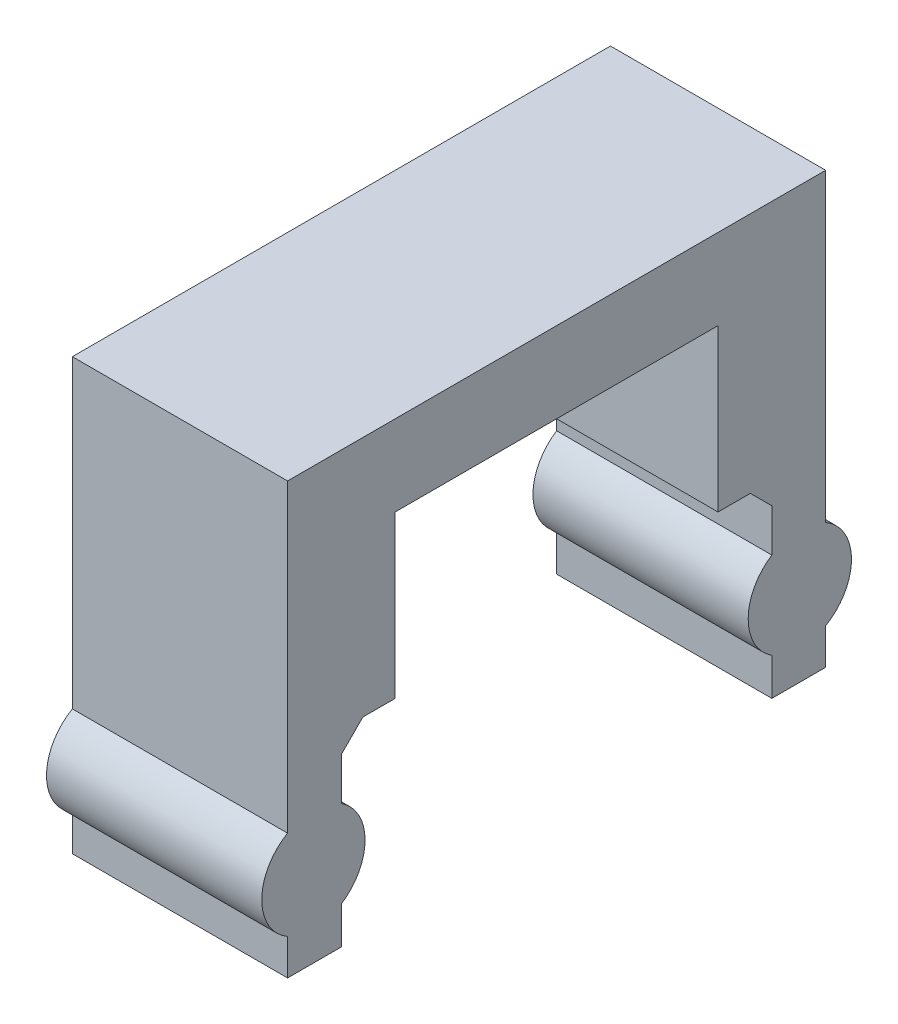
ISO-10303-21;
HEADER;
FILE_DESCRIPTION(('STEP AP214'),'2;1');
FILE_NAME('part.step','',(''),(''),'','','');
FILE_SCHEMA(('AUTOMOTIVE_DESIGN { 1 0 10303 214 1 1 1 1 }'));
ENDSEC;
DATA;
#1=APPLICATION_CONTEXT('core data for automotive mechanical design processes');
#2=APPLICATION_PROTOCOL_DEFINITION('international standard','automotive_design',2000,#1);
#3=PRODUCT_CONTEXT('',#1,'mechanical');
#4=PRODUCT('Part','Part','',(#3));
#5=PRODUCT_RELATED_PRODUCT_CATEGORY('part','',(#4));
#6=PRODUCT_DEFINITION_FORMATION('','',#4);
#7=PRODUCT_DEFINITION_CONTEXT('part definition',#1,'design');
#8=PRODUCT_DEFINITION('design','',#6,#7);
#9=PRODUCT_DEFINITION_SHAPE('','',#8);
#10=(LENGTH_UNIT() NAMED_UNIT(*) SI_UNIT(.MILLI.,.METRE.));
#11=(NAMED_UNIT(*) PLANE_ANGLE_UNIT() SI_UNIT($,.RADIAN.));
#12=(NAMED_UNIT(*) SI_UNIT($,.STERADIAN.) SOLID_ANGLE_UNIT());
#13=UNCERTAINTY_MEASURE_WITH_UNIT(LENGTH_MEASURE(1.E-05),#10,'distance_accuracy_value','');
#14=(GEOMETRIC_REPRESENTATION_CONTEXT(3) GLOBAL_UNCERTAINTY_ASSIGNED_CONTEXT((#13)) GLOBAL_UNIT_ASSIGNED_CONTEXT((#10,
#11,#12)) REPRESENTATION_CONTEXT('',''));
#15=CARTESIAN_POINT('',(0.,0.,0.));
#16=DIRECTION('',(0.,0.,1.));
#17=DIRECTION('',(1.,0.,0.));
#18=AXIS2_PLACEMENT_3D('',#15,#16,#17);
#19=CARTESIAN_POINT('',(25.4,9.94734725305141,44.6955776659082));
#20=DIRECTION('',(0.,0.,-1.));
#21=DIRECTION('',(-1.,0.,0.));
#22=AXIS2_PLACEMENT_3D('',#19,#20,#21);
#23=PLANE('',#22);
#24=DIRECTION('',(0.,-1.,0.));
#25=VECTOR('',#24,1.);
#26=CARTESIAN_POINT('',(25.4,9.94734725305141,44.6955776659082));
#27=LINE('',#26,#25);
#28=CARTESIAN_POINT('',(25.4,7.40734725305139,44.6955776659082));
#29=VERTEX_POINT('',#28);
#30=CARTESIAN_POINT('',(25.4,2.37160446751674,44.6955776659082));
#31=VERTEX_POINT('',#30);
#32=EDGE_CURVE('E362',#29,#31,#27,.T.);
#33=ORIENTED_EDGE('',*,*,#32,.F.);
#34=DIRECTION('',(-1.,0.,0.));
#35=VECTOR('',#34,1.);
#36=CARTESIAN_POINT('',(0.,7.40734725305139,44.6955776659082));
#37=LINE('',#36,#35);
#38=CARTESIAN_POINT('',(0.,7.40734725305139,44.6955776659082));
#39=VERTEX_POINT('',#38);
#40=EDGE_CURVE('E250',#29,#39,#37,.T.);
#41=ORIENTED_EDGE('',*,*,#40,.T.);
#42=DIRECTION('',(0.,-1.,0.));
#43=VECTOR('',#42,1.);
#44=CARTESIAN_POINT('',(0.,9.94734725305141,44.6955776659082));
#45=LINE('',#44,#43);
#46=CARTESIAN_POINT('',(0.,2.37160446751674,44.6955776659082));
#47=VERTEX_POINT('',#46);
#48=EDGE_CURVE('E209',#39,#47,#45,.T.);
#49=ORIENTED_EDGE('',*,*,#48,.T.);
#50=DIRECTION('',(1.,0.,0.));
#51=VECTOR('',#50,1.);
#52=CARTESIAN_POINT('',(0.,2.37160446751674,44.6955776659082));
#53=LINE('',#52,#51);
#54=EDGE_CURVE('E369',#47,#31,#53,.T.);
#55=ORIENTED_EDGE('',*,*,#54,.T.);
#56=EDGE_LOOP('',(#33,#41,#49,#55));
#57=FACE_BOUND('',#56,.T.);
#58=ADVANCED_FACE('F32',(#57),#23,.F.);
#59=CARTESIAN_POINT('',(25.4,-12.2776527469486,38.3455776659082));
#60=DIRECTION('',(0.,0.,1.));
#61=DIRECTION('',(0.,-1.,0.));
#62=AXIS2_PLACEMENT_3D('',#59,#60,#61);
#63=PLANE('',#62);
#64=DIRECTION('',(0.,1.,0.));
#65=VECTOR('',#64,1.);
#66=CARTESIAN_POINT('',(0.,-12.2776527469486,38.3455776659082));
#67=LINE('',#66,#65);
#68=CARTESIAN_POINT('',(0.,-12.2776527469486,38.3455776659082));
#69=VERTEX_POINT('',#68);
#70=CARTESIAN_POINT('',(0.,-8.03194360841852,38.3455776659082));
#71=VERTEX_POINT('',#70);
#72=EDGE_CURVE('E206',#69,#71,#67,.T.);
#73=ORIENTED_EDGE('',*,*,#72,.T.);
#74=DIRECTION('',(1.,0.,0.));
#75=VECTOR('',#74,1.);
#76=CARTESIAN_POINT('',(0.,-8.03194360841852,38.3455776659082));
#77=LINE('',#76,#75);
#78=CARTESIAN_POINT('',(25.4,-8.03194360841852,38.3455776659082));
#79=VERTEX_POINT('',#78);
#80=EDGE_CURVE('E187',#71,#79,#77,.T.);
#81=ORIENTED_EDGE('',*,*,#80,.T.);
#82=DIRECTION('',(0.,1.,0.));
#83=VECTOR('',#82,1.);
#84=CARTESIAN_POINT('',(25.4,-12.2776527469486,38.3455776659082));
#85=LINE('',#84,#83);
#86=CARTESIAN_POINT('',(25.4,-12.2776527469486,38.3455776659082));
#87=VERTEX_POINT('',#86);
#88=EDGE_CURVE('E326',#87,#79,#85,.T.);
#89=ORIENTED_EDGE('',*,*,#88,.F.);
#90=DIRECTION('',(-1.,0.,0.));
#91=VECTOR('',#90,1.);
#92=CARTESIAN_POINT('',(25.4,-12.2776527469486,38.3455776659082));
#93=LINE('',#92,#91);
#94=EDGE_CURVE('E221',#87,#69,#93,.T.);
#95=ORIENTED_EDGE('',*,*,#94,.T.);
#96=EDGE_LOOP('',(#73,#81,#89,#95));
#97=FACE_BOUND('',#96,.T.);
#98=ADVANCED_FACE('F324',(#97),#63,.F.);
#99=CARTESIAN_POINT('',(25.4,38.5223472530514,101.845577665908));
#100=DIRECTION('',(0.,0.,-1.));
#101=DIRECTION('',(0.,1.,0.));
#102=AXIS2_PLACEMENT_3D('',#99,#100,#101);
#103=PLANE('',#102);
#104=DIRECTION('',(0.,-1.,0.));
#105=VECTOR('',#104,1.);
#106=CARTESIAN_POINT('',(0.,38.5223472530514,101.845577665908));
#107=LINE('',#106,#105);
#108=CARTESIAN_POINT('',(0.,38.5223472530514,101.845577665908));
#109=VERTEX_POINT('',#108);
#110=CARTESIAN_POINT('',(0.,2.52663811452136,101.845577665908));
#111=VERTEX_POINT('',#110);
#112=EDGE_CURVE('E293',#109,#111,#107,.T.);
#113=ORIENTED_EDGE('',*,*,#112,.T.);
#114=DIRECTION('',(1.,0.,0.));
#115=VECTOR('',#114,1.);
#116=CARTESIAN_POINT('',(0.,2.52663811452136,101.845577665908));
#117=LINE('',#116,#115);
#118=CARTESIAN_POINT('',(25.4,2.52663811452136,101.845577665908));
#119=VERTEX_POINT('',#118);
#120=EDGE_CURVE('E335',#111,#119,#117,.T.);
#121=ORIENTED_EDGE('',*,*,#120,.T.);
#122=DIRECTION('',(0.,-1.,0.));
#123=VECTOR('',#122,1.);
#124=CARTESIAN_POINT('',(25.4,38.5223472530514,101.845577665908));
#125=LINE('',#124,#123);
#126=CARTESIAN_POINT('',(25.4,38.5223472530514,101.845577665908));
#127=VERTEX_POINT('',#126);
#128=EDGE_CURVE('E349',#127,#119,#125,.T.);
#129=ORIENTED_EDGE('',*,*,#128,.F.);
#130=DIRECTION('',(-1.,0.,0.));
#131=VECTOR('',#130,1.);
#132=CARTESIAN_POINT('',(25.4,38.5223472530514,101.845577665908));
#133=LINE('',#132,#131);
#134=EDGE_CURVE('E215',#127,#109,#133,.T.);
#135=ORIENTED_EDGE('',*,*,#134,.T.);
#136=EDGE_LOOP('',(#113,#121,#129,#135));
#137=FACE_BOUND('',#136,.T.);
#138=ADVANCED_FACE('F408',(#137),#103,.F.);
#139=CARTESIAN_POINT('',(25.4,-12.2776527469486,95.4955776659082));
#140=DIRECTION('',(0.,0.,1.));
#141=DIRECTION('',(1.,0.,0.));
#142=AXIS2_PLACEMENT_3D('',#139,#140,#141);
#143=PLANE('',#142);
#144=DIRECTION('',(0.,1.,0.));
#145=VECTOR('',#144,1.);
#146=CARTESIAN_POINT('',(0.,-12.2776527469486,95.4955776659082));
#147=LINE('',#146,#145);
#148=CARTESIAN_POINT('',(0.,-12.2776527469486,95.4955776659082));
#149=VERTEX_POINT('',#148);
#150=CARTESIAN_POINT('',(0.,-7.87690996141393,95.4955776659082));
#151=VERTEX_POINT('',#150);
#152=EDGE_CURVE('E289',#149,#151,#147,.T.);
#153=ORIENTED_EDGE('',*,*,#152,.T.);
#154=DIRECTION('',(1.,0.,0.));
#155=VECTOR('',#154,1.);
#156=CARTESIAN_POINT('',(0.,-7.87690996141393,95.4955776659082));
#157=LINE('',#156,#155);
#158=CARTESIAN_POINT('',(25.4,-7.87690996141393,95.4955776659082));
#159=VERTEX_POINT('',#158);
#160=EDGE_CURVE('E345',#151,#159,#157,.T.);
#161=ORIENTED_EDGE('',*,*,#160,.T.);
#162=DIRECTION('',(0.,1.,0.));
#163=VECTOR('',#162,1.);
#164=CARTESIAN_POINT('',(25.4,-12.2776527469486,95.4955776659082));
#165=LINE('',#164,#163);
#166=CARTESIAN_POINT('',(25.4,-12.2776527469486,95.4955776659082));
#167=VERTEX_POINT('',#166);
#168=EDGE_CURVE('E275',#167,#159,#165,.T.);
#169=ORIENTED_EDGE('',*,*,#168,.F.);
#170=DIRECTION('',(-1.,0.,0.));
#171=VECTOR('',#170,1.);
#172=CARTESIAN_POINT('',(25.4,-12.2776527469486,95.4955776659082));
#173=LINE('',#172,#171);
#174=EDGE_CURVE('E239',#167,#149,#173,.T.);
#175=ORIENTED_EDGE('',*,*,#174,.T.);
#176=EDGE_LOOP('',(#153,#161,#169,#175));
#177=FACE_BOUND('',#176,.T.);
#178=ADVANCED_FACE('F383',(#177),#143,.F.);
#179=CARTESIAN_POINT('',(25.4,-8.03194360841854,101.845577665908));
#180=VERTEX_POINT('',#179);
#181=CARTESIAN_POINT('',(25.4,-12.2776527469486,101.845577665908));
#182=VERTEX_POINT('',#181);
#183=EDGE_CURVE('E214',#180,#182,#125,.T.);
#184=ORIENTED_EDGE('',*,*,#183,.F.);
#185=DIRECTION('',(1.,0.,0.));
#186=VECTOR('',#185,1.);
#187=CARTESIAN_POINT('',(0.,-8.03194360841854,101.845577665908));
#188=LINE('',#187,#186);
#189=CARTESIAN_POINT('',(0.,-8.03194360841854,101.845577665908));
#190=VERTEX_POINT('',#189);
#191=EDGE_CURVE('E341',#180,#190,#188,.F.);
#192=ORIENTED_EDGE('',*,*,#191,.T.);
#193=CARTESIAN_POINT('',(0.,-12.2776527469486,101.845577665908));
#194=VERTEX_POINT('',#193);
#195=EDGE_CURVE('E332',#190,#194,#107,.T.);
#196=ORIENTED_EDGE('',*,*,#195,.T.);
#197=DIRECTION('',(-1.,0.,0.));
#198=VECTOR('',#197,1.);
#199=CARTESIAN_POINT('',(25.4,-12.2776527469486,101.845577665908));
#200=LINE('',#199,#198);
#201=EDGE_CURVE('E242',#182,#194,#200,.T.);
#202=ORIENTED_EDGE('',*,*,#201,.F.);
#203=EDGE_LOOP('',(#184,#192,#196,#202));
#204=FACE_BOUND('',#203,.T.);
#205=ADVANCED_FACE('F439',(#204),#103,.F.);
#206=CARTESIAN_POINT('',(25.4,-12.2776527469486,101.845577665908));
#207=DIRECTION('',(0.,1.,0.));
#208=DIRECTION('',(0.,0.,1.));
#209=AXIS2_PLACEMENT_3D('',#206,#207,#208);
#210=PLANE('',#209);
#211=DIRECTION('',(0.,0.,-1.));
#212=VECTOR('',#211,1.);
#213=CARTESIAN_POINT('',(0.,-12.2776527469486,101.845577665908));
#214=LINE('',#213,#212);
#215=EDGE_CURVE('E290',#194,#149,#214,.T.);
#216=ORIENTED_EDGE('',*,*,#215,.T.);
#217=ORIENTED_EDGE('',*,*,#174,.F.);
#218=DIRECTION('',(0.,0.,-1.));
#219=VECTOR('',#218,1.);
#220=CARTESIAN_POINT('',(25.4,-12.2776527469486,101.845577665908));
#221=LINE('',#220,#219);
#222=EDGE_CURVE('E351',#182,#167,#221,.T.);
#223=ORIENTED_EDGE('',*,*,#222,.F.);
#224=ORIENTED_EDGE('',*,*,#201,.T.);
#225=EDGE_LOOP('',(#216,#217,#223,#224));
#226=FACE_BOUND('',#225,.T.);
#227=ADVANCED_FACE('F390',(#226),#210,.F.);
#228=CARTESIAN_POINT('',(0.,2.37160446751675,95.4955776659082));
#229=VERTEX_POINT('',#228);
#230=CARTESIAN_POINT('',(0.,7.40734725305142,95.4955776659082));
#231=VERTEX_POINT('',#230);
#232=EDGE_CURVE('E281',#229,#231,#147,.T.);
#233=ORIENTED_EDGE('',*,*,#232,.T.);
#234=DIRECTION('',(1.,0.,0.));
#235=VECTOR('',#234,1.);
#236=CARTESIAN_POINT('',(25.4,7.40734725305142,95.4955776659082));
#237=LINE('',#236,#235);
#238=CARTESIAN_POINT('',(25.4,7.40734725305142,95.4955776659082));
#239=VERTEX_POINT('',#238);
#240=EDGE_CURVE('E248',#231,#239,#237,.T.);
#241=ORIENTED_EDGE('',*,*,#240,.T.);
#242=CARTESIAN_POINT('',(25.4,2.37160446751675,95.4955776659082));
#243=VERTEX_POINT('',#242);
#244=EDGE_CURVE('E266',#243,#239,#165,.T.);
#245=ORIENTED_EDGE('',*,*,#244,.F.);
#246=DIRECTION('',(1.,0.,0.));
#247=VECTOR('',#246,1.);
#248=CARTESIAN_POINT('',(0.,2.37160446751675,95.4955776659082));
#249=LINE('',#248,#247);
#250=EDGE_CURVE('E288',#243,#229,#249,.F.);
#251=ORIENTED_EDGE('',*,*,#250,.T.);
#252=EDGE_LOOP('',(#233,#241,#245,#251));
#253=FACE_BOUND('',#252,.T.);
#254=ADVANCED_FACE('F286',(#253),#143,.F.);
#255=CARTESIAN_POINT('',(25.4,9.94734725305141,95.4955776659082));
#256=DIRECTION('',(0.,1.,0.));
#257=DIRECTION('',(0.,0.,1.));
#258=AXIS2_PLACEMENT_3D('',#255,#256,#257);
#259=PLANE('',#258);
#260=DIRECTION('',(0.,0.,-1.));
#261=VECTOR('',#260,1.);
#262=CARTESIAN_POINT('',(25.4,9.94734725305141,95.4955776659082));
#263=LINE('',#262,#261);
#264=CARTESIAN_POINT('',(25.4,9.94734725305141,92.9555776659082));
#265=VERTEX_POINT('',#264);
#266=CARTESIAN_POINT('',(25.4,9.94734725305141,89.1455776659082));
#267=VERTEX_POINT('',#266);
#268=EDGE_CURVE('E263',#265,#267,#263,.T.);
#269=ORIENTED_EDGE('',*,*,#268,.F.);
#270=DIRECTION('',(-1.,0.,0.));
#271=VECTOR('',#270,1.);
#272=CARTESIAN_POINT('',(0.,9.94734725305141,92.9555776659082));
#273=LINE('',#272,#271);
#274=CARTESIAN_POINT('',(0.,9.94734725305141,92.9555776659082));
#275=VERTEX_POINT('',#274);
#276=EDGE_CURVE('E245',#265,#275,#273,.T.);
#277=ORIENTED_EDGE('',*,*,#276,.T.);
#278=DIRECTION('',(0.,0.,-1.));
#279=VECTOR('',#278,1.);
#280=CARTESIAN_POINT('',(0.,9.94734725305141,95.4955776659082));
#281=LINE('',#280,#279);
#282=CARTESIAN_POINT('',(0.,9.94734725305141,89.1455776659082));
#283=VERTEX_POINT('',#282);
#284=EDGE_CURVE('E283',#275,#283,#281,.T.);
#285=ORIENTED_EDGE('',*,*,#284,.T.);
#286=DIRECTION('',(-1.,0.,0.));
#287=VECTOR('',#286,1.);
#288=CARTESIAN_POINT('',(25.4,9.94734725305141,89.1455776659082));
#289=LINE('',#288,#287);
#290=EDGE_CURVE('E236',#267,#283,#289,.T.);
#291=ORIENTED_EDGE('',*,*,#290,.F.);
#292=EDGE_LOOP('',(#269,#277,#285,#291));
#293=FACE_BOUND('',#292,.T.);
#294=ADVANCED_FACE('F271',(#293),#259,.F.);
#295=CARTESIAN_POINT('',(25.4,9.94734725305141,89.1455776659082));
#296=DIRECTION('',(0.,0.,1.));
#297=DIRECTION('',(1.,0.,0.));
#298=AXIS2_PLACEMENT_3D('',#295,#296,#297);
#299=PLANE('',#298);
#300=DIRECTION('',(0.,1.,0.));
#301=VECTOR('',#300,1.);
#302=CARTESIAN_POINT('',(0.,9.94734725305141,89.1455776659082));
#303=LINE('',#302,#301);
#304=CARTESIAN_POINT('',(0.,28.9973472530514,89.1455776659082));
#305=VERTEX_POINT('',#304);
#306=EDGE_CURVE('E298',#283,#305,#303,.T.);
#307=ORIENTED_EDGE('',*,*,#306,.T.);
#308=DIRECTION('',(-1.,0.,0.));
#309=VECTOR('',#308,1.);
#310=CARTESIAN_POINT('',(25.4,28.9973472530514,89.1455776659082));
#311=LINE('',#310,#309);
#312=CARTESIAN_POINT('',(25.4,28.9973472530514,89.1455776659082));
#313=VERTEX_POINT('',#312);
#314=EDGE_CURVE('E233',#313,#305,#311,.T.);
#315=ORIENTED_EDGE('',*,*,#314,.F.);
#316=DIRECTION('',(0.,1.,0.));
#317=VECTOR('',#316,1.);
#318=CARTESIAN_POINT('',(25.4,9.94734725305141,89.1455776659082));
#319=LINE('',#318,#317);
#320=EDGE_CURVE('E274',#267,#313,#319,.T.);
#321=ORIENTED_EDGE('',*,*,#320,.F.);
#322=ORIENTED_EDGE('',*,*,#290,.T.);
#323=EDGE_LOOP('',(#307,#315,#321,#322));
#324=FACE_BOUND('',#323,.T.);
#325=ADVANCED_FACE('F428',(#324),#299,.F.);
#326=CARTESIAN_POINT('',(25.4,28.9973472530514,89.1455776659082));
#327=DIRECTION('',(0.,1.,0.));
#328=DIRECTION('',(0.,0.,1.));
#329=AXIS2_PLACEMENT_3D('',#326,#327,#328);
#330=PLANE('',#329);
#331=DIRECTION('',(0.,0.,-1.));
#332=VECTOR('',#331,1.);
#333=CARTESIAN_POINT('',(0.,28.9973472530514,89.1455776659082));
#334=LINE('',#333,#332);
#335=CARTESIAN_POINT('',(0.,28.9973472530514,51.0455776659082));
#336=VERTEX_POINT('',#335);
#337=EDGE_CURVE('E300',#305,#336,#334,.T.);
#338=ORIENTED_EDGE('',*,*,#337,.T.);
#339=DIRECTION('',(-1.,0.,0.));
#340=VECTOR('',#339,1.);
#341=CARTESIAN_POINT('',(25.4,28.9973472530514,51.0455776659082));
#342=LINE('',#341,#340);
#343=CARTESIAN_POINT('',(25.4,28.9973472530514,51.0455776659082));
#344=VERTEX_POINT('',#343);
#345=EDGE_CURVE('E230',#344,#336,#342,.T.);
#346=ORIENTED_EDGE('',*,*,#345,.F.);
#347=DIRECTION('',(0.,0.,-1.));
#348=VECTOR('',#347,1.);
#349=CARTESIAN_POINT('',(25.4,28.9973472530514,89.1455776659082));
#350=LINE('',#349,#348);
#351=EDGE_CURVE('E356',#313,#344,#350,.T.);
#352=ORIENTED_EDGE('',*,*,#351,.F.);
#353=ORIENTED_EDGE('',*,*,#314,.T.);
#354=EDGE_LOOP('',(#338,#346,#352,#353));
#355=FACE_BOUND('',#354,.T.);
#356=ADVANCED_FACE('F422',(#355),#330,.F.);
#357=CARTESIAN_POINT('',(25.4,28.9973472530514,51.0455776659082));
#358=DIRECTION('',(0.,0.,-1.));
#359=DIRECTION('',(-1.,0.,0.));
#360=AXIS2_PLACEMENT_3D('',#357,#358,#359);
#361=PLANE('',#360);
#362=DIRECTION('',(0.,-1.,0.));
#363=VECTOR('',#362,1.);
#364=CARTESIAN_POINT('',(0.,28.9973472530514,51.0455776659082));
#365=LINE('',#364,#363);
#366=CARTESIAN_POINT('',(0.,9.94734725305141,51.0455776659082));
#367=VERTEX_POINT('',#366);
#368=EDGE_CURVE('E302',#336,#367,#365,.T.);
#369=ORIENTED_EDGE('',*,*,#368,.T.);
#370=DIRECTION('',(-1.,0.,0.));
#371=VECTOR('',#370,1.);
#372=CARTESIAN_POINT('',(25.4,9.94734725305141,51.0455776659082));
#373=LINE('',#372,#371);
#374=CARTESIAN_POINT('',(25.4,9.94734725305141,51.0455776659082));
#375=VERTEX_POINT('',#374);
#376=EDGE_CURVE('E227',#375,#367,#373,.T.);
#377=ORIENTED_EDGE('',*,*,#376,.F.);
#378=DIRECTION('',(0.,-1.,0.));
#379=VECTOR('',#378,1.);
#380=CARTESIAN_POINT('',(25.4,28.9973472530514,51.0455776659082));
#381=LINE('',#380,#379);
#382=EDGE_CURVE('E358',#344,#375,#381,.T.);
#383=ORIENTED_EDGE('',*,*,#382,.F.);
#384=ORIENTED_EDGE('',*,*,#345,.T.);
#385=EDGE_LOOP('',(#369,#377,#383,#384));
#386=FACE_BOUND('',#385,.T.);
#387=ADVANCED_FACE('F418',(#386),#361,.F.);
#388=CARTESIAN_POINT('',(25.4,9.94734725305141,51.0455776659082));
#389=DIRECTION('',(0.,1.,0.));
#390=DIRECTION('',(0.,0.,1.));
#391=AXIS2_PLACEMENT_3D('',#388,#389,#390);
#392=PLANE('',#391);
#393=DIRECTION('',(0.,0.,-1.));
#394=VECTOR('',#393,1.);
#395=CARTESIAN_POINT('',(0.,9.94734725305141,51.0455776659082));
#396=LINE('',#395,#394);
#397=CARTESIAN_POINT('',(0.,9.94734725305141,47.2355776659082));
#398=VERTEX_POINT('',#397);
#399=EDGE_CURVE('E304',#367,#398,#396,.T.);
#400=ORIENTED_EDGE('',*,*,#399,.T.);
#401=DIRECTION('',(1.,0.,0.));
#402=VECTOR('',#401,1.);
#403=CARTESIAN_POINT('',(25.4,9.94734725305141,47.2355776659082));
#404=LINE('',#403,#402);
#405=CARTESIAN_POINT('',(25.4,9.94734725305141,47.2355776659082));
#406=VERTEX_POINT('',#405);
#407=EDGE_CURVE('E47',#398,#406,#404,.T.);
#408=ORIENTED_EDGE('',*,*,#407,.T.);
#409=DIRECTION('',(0.,0.,-1.));
#410=VECTOR('',#409,1.);
#411=CARTESIAN_POINT('',(25.4,9.94734725305141,51.0455776659082));
#412=LINE('',#411,#410);
#413=EDGE_CURVE('E360',#375,#406,#412,.T.);
#414=ORIENTED_EDGE('',*,*,#413,.F.);
#415=ORIENTED_EDGE('',*,*,#376,.T.);
#416=EDGE_LOOP('',(#400,#408,#414,#415));
#417=FACE_BOUND('',#416,.T.);
#418=ADVANCED_FACE('F413',(#417),#392,.F.);
#419=CARTESIAN_POINT('',(25.4,-7.87690996141392,44.6955776659082));
#420=VERTEX_POINT('',#419);
#421=CARTESIAN_POINT('',(25.4,-12.2776527469486,44.6955776659082));
#422=VERTEX_POINT('',#421);
#423=EDGE_CURVE('E361',#420,#422,#27,.T.);
#424=ORIENTED_EDGE('',*,*,#423,.F.);
#425=DIRECTION('',(1.,0.,0.));
#426=VECTOR('',#425,1.);
#427=CARTESIAN_POINT('',(0.,-7.87690996141392,44.6955776659082));
#428=LINE('',#427,#426);
#429=CARTESIAN_POINT('',(0.,-7.87690996141392,44.6955776659082));
#430=VERTEX_POINT('',#429);
#431=EDGE_CURVE('E316',#420,#430,#428,.F.);
#432=ORIENTED_EDGE('',*,*,#431,.T.);
#433=CARTESIAN_POINT('',(0.,-12.2776527469486,44.6955776659082));
#434=VERTEX_POINT('',#433);
#435=EDGE_CURVE('E305',#430,#434,#45,.T.);
#436=ORIENTED_EDGE('',*,*,#435,.T.);
#437=DIRECTION('',(-1.,0.,0.));
#438=VECTOR('',#437,1.);
#439=CARTESIAN_POINT('',(25.4,-12.2776527469486,44.6955776659082));
#440=LINE('',#439,#438);
#441=EDGE_CURVE('E224',#422,#434,#440,.T.);
#442=ORIENTED_EDGE('',*,*,#441,.F.);
#443=EDGE_LOOP('',(#424,#432,#436,#442));
#444=FACE_BOUND('',#443,.T.);
#445=ADVANCED_FACE('F313',(#444),#23,.F.);
#446=CARTESIAN_POINT('',(25.4,-12.2776527469486,44.6955776659082));
#447=DIRECTION('',(0.,1.,0.));
#448=DIRECTION('',(0.,0.,1.));
#449=AXIS2_PLACEMENT_3D('',#446,#447,#448);
#450=PLANE('',#449);
#451=DIRECTION('',(0.,0.,-1.));
#452=VECTOR('',#451,1.);
#453=CARTESIAN_POINT('',(0.,-12.2776527469486,44.6955776659082));
#454=LINE('',#453,#452);
#455=EDGE_CURVE('E207',#434,#69,#454,.T.);
#456=ORIENTED_EDGE('',*,*,#455,.T.);
#457=ORIENTED_EDGE('',*,*,#94,.F.);
#458=DIRECTION('',(0.,0.,-1.));
#459=VECTOR('',#458,1.);
#460=CARTESIAN_POINT('',(25.4,-12.2776527469486,44.6955776659082));
#461=LINE('',#460,#459);
#462=EDGE_CURVE('E322',#422,#87,#461,.T.);
#463=ORIENTED_EDGE('',*,*,#462,.F.);
#464=ORIENTED_EDGE('',*,*,#441,.T.);
#465=EDGE_LOOP('',(#456,#457,#463,#464));
#466=FACE_BOUND('',#465,.T.);
#467=ADVANCED_FACE('F320',(#466),#450,.F.);
#468=CARTESIAN_POINT('',(25.4,2.52663811452134,38.3455776659082));
#469=VERTEX_POINT('',#468);
#470=CARTESIAN_POINT('',(25.4,38.5223472530514,38.3455776659082));
#471=VERTEX_POINT('',#470);
#472=EDGE_CURVE('E199',#469,#471,#85,.T.);
#473=ORIENTED_EDGE('',*,*,#472,.F.);
#474=DIRECTION('',(1.,0.,0.));
#475=VECTOR('',#474,1.);
#476=CARTESIAN_POINT('',(0.,2.52663811452134,38.3455776659082));
#477=LINE('',#476,#475);
#478=CARTESIAN_POINT('',(0.,2.52663811452134,38.3455776659082));
#479=VERTEX_POINT('',#478);
#480=EDGE_CURVE('E184',#469,#479,#477,.F.);
#481=ORIENTED_EDGE('',*,*,#480,.T.);
#482=CARTESIAN_POINT('',(0.,38.5223472530514,38.3455776659082));
#483=VERTEX_POINT('',#482);
#484=EDGE_CURVE('E197',#479,#483,#67,.T.);
#485=ORIENTED_EDGE('',*,*,#484,.T.);
#486=DIRECTION('',(-1.,0.,0.));
#487=VECTOR('',#486,1.);
#488=CARTESIAN_POINT('',(25.4,38.5223472530514,38.3455776659082));
#489=LINE('',#488,#487);
#490=EDGE_CURVE('E218',#471,#483,#489,.T.);
#491=ORIENTED_EDGE('',*,*,#490,.F.);
#492=EDGE_LOOP('',(#473,#481,#485,#491));
#493=FACE_BOUND('',#492,.T.);
#494=ADVANCED_FACE('F195',(#493),#63,.F.);
#495=CARTESIAN_POINT('',(25.4,38.5223472530514,38.3455776659082));
#496=DIRECTION('',(0.,-1.,0.));
#497=DIRECTION('',(0.,0.,-1.));
#498=AXIS2_PLACEMENT_3D('',#495,#496,#497);
#499=PLANE('',#498);
#500=DIRECTION('',(0.,0.,1.));
#501=VECTOR('',#500,1.);
#502=CARTESIAN_POINT('',(0.,38.5223472530514,38.3455776659082));
#503=LINE('',#502,#501);
#504=EDGE_CURVE('E205',#483,#109,#503,.T.);
#505=ORIENTED_EDGE('',*,*,#504,.T.);
#506=ORIENTED_EDGE('',*,*,#134,.F.);
#507=DIRECTION('',(0.,0.,1.));
#508=VECTOR('',#507,1.);
#509=CARTESIAN_POINT('',(25.4,38.5223472530514,38.3455776659082));
#510=LINE('',#509,#508);
#511=EDGE_CURVE('E219',#471,#127,#510,.T.);
#512=ORIENTED_EDGE('',*,*,#511,.F.);
#513=ORIENTED_EDGE('',*,*,#490,.T.);
#514=EDGE_LOOP('',(#505,#506,#512,#513));
#515=FACE_BOUND('',#514,.T.);
#516=ADVANCED_FACE('F469',(#515),#499,.F.);
#517=CARTESIAN_POINT('',(25.4,-12.2776527469486,101.845577665908));
#518=DIRECTION('',(1.,0.,0.));
#519=DIRECTION('',(0.,0.,-1.));
#520=AXIS2_PLACEMENT_3D('',#517,#518,#519);
#521=PLANE('',#520);
#522=ORIENTED_EDGE('',*,*,#88,.T.);
#523=CARTESIAN_POINT('',(25.4,-2.75265274694859,41.3935776659082));
#524=DIRECTION('',(1.,0.,0.));
#525=DIRECTION('',(0.,0.,-1.));
#526=AXIS2_PLACEMENT_3D('',#523,#524,#525);
#527=CIRCLE('',#526,6.096);
#528=EDGE_CURVE('E366',#79,#469,#527,.T.);
#529=ORIENTED_EDGE('',*,*,#528,.T.);
#530=ORIENTED_EDGE('',*,*,#472,.T.);
#531=ORIENTED_EDGE('',*,*,#511,.T.);
#532=ORIENTED_EDGE('',*,*,#128,.T.);
#533=CARTESIAN_POINT('',(25.4,-2.75265274694859,98.7975776659082));
#534=DIRECTION('',(1.,0.,0.));
#535=DIRECTION('',(0.,0.,-1.));
#536=AXIS2_PLACEMENT_3D('',#533,#534,#535);
#537=CIRCLE('',#536,6.09600000000001);
#538=EDGE_CURVE('E378',#119,#180,#537,.T.);
#539=ORIENTED_EDGE('',*,*,#538,.T.);
#540=ORIENTED_EDGE('',*,*,#183,.T.);
#541=ORIENTED_EDGE('',*,*,#222,.T.);
#542=ORIENTED_EDGE('',*,*,#168,.T.);
#543=EDGE_CURVE('E371',#159,#243,#537,.T.);
#544=ORIENTED_EDGE('',*,*,#543,.T.);
#545=ORIENTED_EDGE('',*,*,#244,.T.);
#546=DIRECTION('',(0.,-0.707106781186542,0.707106781186553));
#547=VECTOR('',#546,1.);
#548=CARTESIAN_POINT('',(25.4,9.94734725305141,92.9555776659082));
#549=LINE('',#548,#547);
#550=EDGE_CURVE('E256',#239,#265,#549,.F.);
#551=ORIENTED_EDGE('',*,*,#550,.T.);
#552=ORIENTED_EDGE('',*,*,#268,.T.);
#553=ORIENTED_EDGE('',*,*,#320,.T.);
#554=ORIENTED_EDGE('',*,*,#351,.T.);
#555=ORIENTED_EDGE('',*,*,#382,.T.);
#556=ORIENTED_EDGE('',*,*,#413,.T.);
#557=DIRECTION('',(0.,0.707106781186551,0.707106781186544));
#558=VECTOR('',#557,1.);
#559=CARTESIAN_POINT('',(25.4,7.40734725305139,44.6955776659082));
#560=LINE('',#559,#558);
#561=EDGE_CURVE('E11',#406,#29,#560,.F.);
#562=ORIENTED_EDGE('',*,*,#561,.T.);
#563=ORIENTED_EDGE('',*,*,#32,.T.);
#564=EDGE_CURVE('E192',#31,#420,#527,.T.);
#565=ORIENTED_EDGE('',*,*,#564,.T.);
#566=ORIENTED_EDGE('',*,*,#423,.T.);
#567=ORIENTED_EDGE('',*,*,#462,.T.);
#568=EDGE_LOOP('',(#522,#529,#530,#531,#532,#539,#540,#541,#542,#544,#545,#551,#552,#553,#554,
#555,#556,#562,#563,#565,#566,#567));
#569=FACE_BOUND('',#568,.T.);
#570=ADVANCED_FACE('F262',(#569),#521,.T.);
#571=CARTESIAN_POINT('',(0.,-12.2776527469486,101.845577665908));
#572=DIRECTION('',(1.,0.,0.));
#573=DIRECTION('',(0.,0.,-1.));
#574=AXIS2_PLACEMENT_3D('',#571,#572,#573);
#575=PLANE('',#574);
#576=ORIENTED_EDGE('',*,*,#435,.F.);
#577=CARTESIAN_POINT('',(0.,-2.75265274694859,41.3935776659082));
#578=DIRECTION('',(1.,0.,0.));
#579=DIRECTION('',(0.,0.,-1.));
#580=AXIS2_PLACEMENT_3D('',#577,#578,#579);
#581=CIRCLE('',#580,6.096);
#582=EDGE_CURVE('E191',#47,#430,#581,.T.);
#583=ORIENTED_EDGE('',*,*,#582,.F.);
#584=ORIENTED_EDGE('',*,*,#48,.F.);
#585=DIRECTION('',(0.,-0.707106781186551,-0.707106781186544));
#586=VECTOR('',#585,1.);
#587=CARTESIAN_POINT('',(0.,26.1398472530513,63.4280776659079));
#588=LINE('',#587,#586);
#589=EDGE_CURVE('E40',#39,#398,#588,.F.);
#590=ORIENTED_EDGE('',*,*,#589,.T.);
#591=ORIENTED_EDGE('',*,*,#399,.F.);
#592=ORIENTED_EDGE('',*,*,#368,.F.);
#593=ORIENTED_EDGE('',*,*,#337,.F.);
#594=ORIENTED_EDGE('',*,*,#306,.F.);
#595=ORIENTED_EDGE('',*,*,#284,.F.);
#596=DIRECTION('',(0.,0.707106781186542,-0.707106781186553));
#597=VECTOR('',#596,1.);
#598=CARTESIAN_POINT('',(0.,-5.61015274694842,108.513077665908));
#599=LINE('',#598,#597);
#600=EDGE_CURVE('E254',#275,#231,#599,.F.);
#601=ORIENTED_EDGE('',*,*,#600,.T.);
#602=ORIENTED_EDGE('',*,*,#232,.F.);
#603=CARTESIAN_POINT('',(0.,-2.75265274694859,98.7975776659082));
#604=DIRECTION('',(1.,0.,0.));
#605=DIRECTION('',(0.,0.,-1.));
#606=AXIS2_PLACEMENT_3D('',#603,#604,#605);
#607=CIRCLE('',#606,6.09600000000001);
#608=EDGE_CURVE('E375',#151,#229,#607,.T.);
#609=ORIENTED_EDGE('',*,*,#608,.F.);
#610=ORIENTED_EDGE('',*,*,#152,.F.);
#611=ORIENTED_EDGE('',*,*,#215,.F.);
#612=ORIENTED_EDGE('',*,*,#195,.F.);
#613=EDGE_CURVE('E377',#111,#190,#607,.T.);
#614=ORIENTED_EDGE('',*,*,#613,.F.);
#615=ORIENTED_EDGE('',*,*,#112,.F.);
#616=ORIENTED_EDGE('',*,*,#504,.F.);
#617=ORIENTED_EDGE('',*,*,#484,.F.);
#618=EDGE_CURVE('E181',#71,#479,#581,.T.);
#619=ORIENTED_EDGE('',*,*,#618,.F.);
#620=ORIENTED_EDGE('',*,*,#72,.F.);
#621=ORIENTED_EDGE('',*,*,#455,.F.);
#622=EDGE_LOOP('',(#576,#583,#584,#590,#591,#592,#593,#594,#595,#601,#602,#609,#610,#611,#612,
#614,#615,#616,#617,#619,#620,#621));
#623=FACE_BOUND('',#622,.T.);
#624=ADVANCED_FACE('F203',(#623),#575,.F.);
#625=CARTESIAN_POINT('',(0.,-2.75265274694859,98.7975776659082));
#626=DIRECTION('',(1.,0.,0.));
#627=DIRECTION('',(0.,0.,-1.));
#628=AXIS2_PLACEMENT_3D('',#625,#626,#627);
#629=CYLINDRICAL_SURFACE('',#628,6.09600000000001);
#630=ORIENTED_EDGE('',*,*,#160,.F.);
#631=ORIENTED_EDGE('',*,*,#608,.T.);
#632=ORIENTED_EDGE('',*,*,#250,.F.);
#633=ORIENTED_EDGE('',*,*,#543,.F.);
#634=EDGE_LOOP('',(#630,#631,#632,#633));
#635=FACE_BOUND('',#634,.T.);
#636=ADVANCED_FACE('F391',(#635),#629,.T.);
#637=ORIENTED_EDGE('',*,*,#120,.F.);
#638=ORIENTED_EDGE('',*,*,#613,.T.);
#639=ORIENTED_EDGE('',*,*,#191,.F.);
#640=ORIENTED_EDGE('',*,*,#538,.F.);
#641=EDGE_LOOP('',(#637,#638,#639,#640));
#642=FACE_BOUND('',#641,.T.);
#643=ADVANCED_FACE('F393',(#642),#629,.T.);
#644=CARTESIAN_POINT('',(0.,-2.75265274694859,41.3935776659082));
#645=DIRECTION('',(1.,0.,0.));
#646=DIRECTION('',(0.,0.,-1.));
#647=AXIS2_PLACEMENT_3D('',#644,#645,#646);
#648=CYLINDRICAL_SURFACE('',#647,6.096);
#649=ORIENTED_EDGE('',*,*,#80,.F.);
#650=ORIENTED_EDGE('',*,*,#618,.T.);
#651=ORIENTED_EDGE('',*,*,#480,.F.);
#652=ORIENTED_EDGE('',*,*,#528,.F.);
#653=EDGE_LOOP('',(#649,#650,#651,#652));
#654=FACE_BOUND('',#653,.T.);
#655=ADVANCED_FACE('F183',(#654),#648,.T.);
#656=ORIENTED_EDGE('',*,*,#54,.F.);
#657=ORIENTED_EDGE('',*,*,#582,.T.);
#658=ORIENTED_EDGE('',*,*,#431,.F.);
#659=ORIENTED_EDGE('',*,*,#564,.F.);
#660=EDGE_LOOP('',(#656,#657,#658,#659));
#661=FACE_BOUND('',#660,.T.);
#662=ADVANCED_FACE('F368',(#661),#648,.T.);
#663=CARTESIAN_POINT('',(25.4,9.94734725305141,92.9555776659082));
#664=DIRECTION('',(0.,-0.707106781186553,-0.707106781186542));
#665=DIRECTION('',(0.,0.707106781186542,-0.707106781186553));
#666=AXIS2_PLACEMENT_3D('',#663,#664,#665);
#667=PLANE('',#666);
#668=ORIENTED_EDGE('',*,*,#550,.F.);
#669=ORIENTED_EDGE('',*,*,#240,.F.);
#670=ORIENTED_EDGE('',*,*,#600,.F.);
#671=ORIENTED_EDGE('',*,*,#276,.F.);
#672=EDGE_LOOP('',(#668,#669,#670,#671));
#673=FACE_BOUND('',#672,.T.);
#674=ADVANCED_FACE('F277',(#673),#667,.T.);
#675=CARTESIAN_POINT('',(25.4,7.40734725305139,44.6955776659082));
#676=DIRECTION('',(0.,-0.707106781186544,0.707106781186551));
#677=DIRECTION('',(0.,-0.707106781186551,-0.707106781186544));
#678=AXIS2_PLACEMENT_3D('',#675,#676,#677);
#679=PLANE('',#678);
#680=ORIENTED_EDGE('',*,*,#561,.F.);
#681=ORIENTED_EDGE('',*,*,#407,.F.);
#682=ORIENTED_EDGE('',*,*,#589,.F.);
#683=ORIENTED_EDGE('',*,*,#40,.F.);
#684=EDGE_LOOP('',(#680,#681,#682,#683));
#685=FACE_BOUND('',#684,.T.);
#686=ADVANCED_FACE('F34',(#685),#679,.T.);
#687=CLOSED_SHELL('',(#58,#98,#138,#178,#205,#227,#254,#294,#325,#356,#387,#418,#445,#467,#494,
#516,#570,#624,#636,#643,#655,#662,#674,#686));
#688=MANIFOLD_SOLID_BREP('B2',#687);
#689=ADVANCED_BREP_SHAPE_REPRESENTATION('',(#18,#688),#14);
#690=SHAPE_DEFINITION_REPRESENTATION(#9,#689);
ENDSEC;
END-ISO-10303-21;
